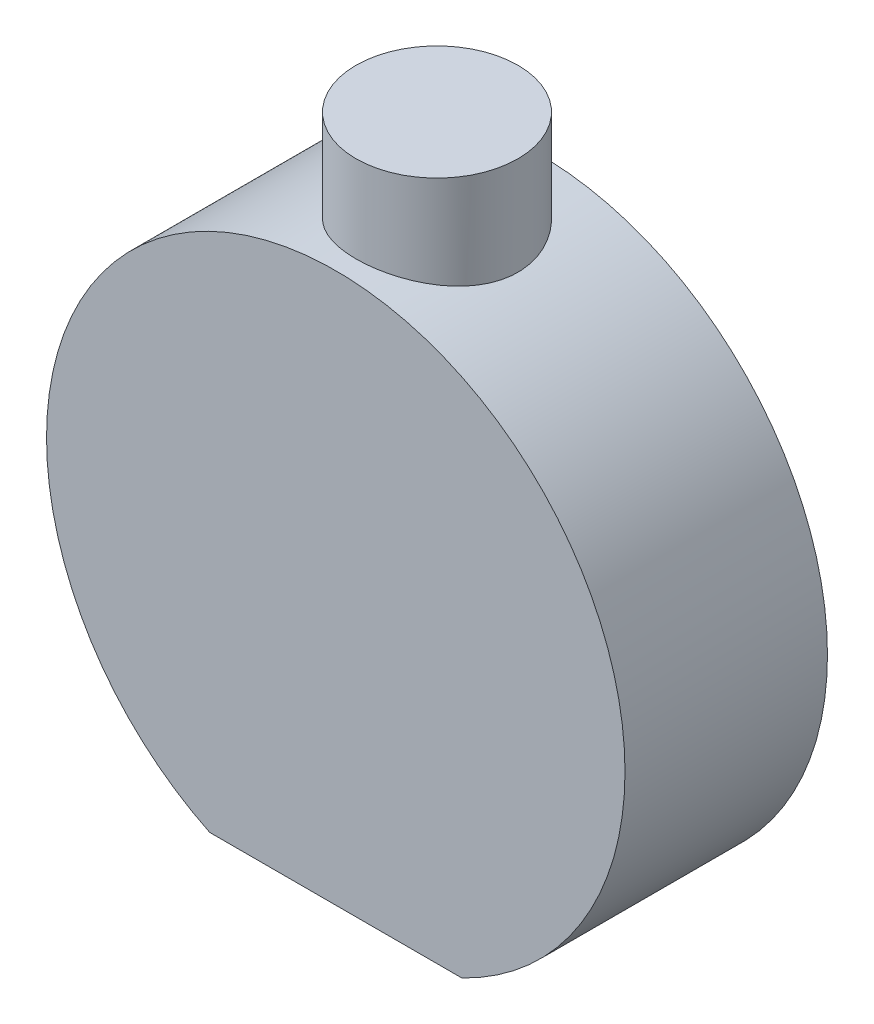
ISO-10303-21;
HEADER;
FILE_DESCRIPTION(('STEP AP214'),'2;1');
FILE_NAME('part.step','',(''),(''),'','','');
FILE_SCHEMA(('AUTOMOTIVE_DESIGN { 1 0 10303 214 1 1 1 1 }'));
ENDSEC;
DATA;
#1=APPLICATION_CONTEXT('core data for automotive mechanical design processes');
#2=APPLICATION_PROTOCOL_DEFINITION('international standard','automotive_design',2000,#1);
#3=PRODUCT_CONTEXT('',#1,'mechanical');
#4=PRODUCT('Part','Part','',(#3));
#5=PRODUCT_RELATED_PRODUCT_CATEGORY('part','',(#4));
#6=PRODUCT_DEFINITION_FORMATION('','',#4);
#7=PRODUCT_DEFINITION_CONTEXT('part definition',#1,'design');
#8=PRODUCT_DEFINITION('design','',#6,#7);
#9=PRODUCT_DEFINITION_SHAPE('','',#8);
#10=(LENGTH_UNIT() NAMED_UNIT(*) SI_UNIT(.MILLI.,.METRE.));
#11=(NAMED_UNIT(*) PLANE_ANGLE_UNIT() SI_UNIT($,.RADIAN.));
#12=(NAMED_UNIT(*) SI_UNIT($,.STERADIAN.) SOLID_ANGLE_UNIT());
#13=UNCERTAINTY_MEASURE_WITH_UNIT(LENGTH_MEASURE(1.E-05),#10,'distance_accuracy_value','');
#14=(GEOMETRIC_REPRESENTATION_CONTEXT(3) GLOBAL_UNCERTAINTY_ASSIGNED_CONTEXT((#13)) GLOBAL_UNIT_ASSIGNED_CONTEXT((#10,
#11,#12)) REPRESENTATION_CONTEXT('',''));
#15=CARTESIAN_POINT('',(0.,0.,0.));
#16=DIRECTION('',(0.,0.,1.));
#17=DIRECTION('',(1.,0.,0.));
#18=AXIS2_PLACEMENT_3D('',#15,#16,#17);
#19=CARTESIAN_POINT('',(0.,0.,35.));
#20=DIRECTION('',(0.,0.,-1.));
#21=DIRECTION('',(-1.,0.,0.));
#22=AXIS2_PLACEMENT_3D('',#19,#20,#21);
#23=CYLINDRICAL_SURFACE('',#22,50.);
#24=CARTESIAN_POINT('',(0.,0.,35.));
#25=DIRECTION('',(0.,0.,1.));
#26=DIRECTION('',(1.,0.,0.));
#27=AXIS2_PLACEMENT_3D('',#24,#25,#26);
#28=CIRCLE('',#27,50.);
#29=CARTESIAN_POINT('',(21.7944947177034,-45.,35.));
#30=VERTEX_POINT('',#29);
#31=CARTESIAN_POINT('',(-21.7944947177034,-45.,35.));
#32=VERTEX_POINT('',#31);
#33=EDGE_CURVE('E70',#30,#32,#28,.T.);
#34=ORIENTED_EDGE('',*,*,#33,.F.);
#35=DIRECTION('',(0.,0.,-1.));
#36=VECTOR('',#35,1.);
#37=CARTESIAN_POINT('',(21.7944947177034,-45.,35.));
#38=LINE('',#37,#36);
#39=CARTESIAN_POINT('',(21.7944947177034,-45.,0.));
#40=VERTEX_POINT('',#39);
#41=EDGE_CURVE('E56',#30,#40,#38,.T.);
#42=ORIENTED_EDGE('',*,*,#41,.T.);
#43=CARTESIAN_POINT('',(0.,0.,0.));
#44=DIRECTION('',(0.,0.,1.));
#45=DIRECTION('',(1.,0.,0.));
#46=AXIS2_PLACEMENT_3D('',#43,#44,#45);
#47=CIRCLE('',#46,50.);
#48=CARTESIAN_POINT('',(-21.7944947177034,-45.,0.));
#49=VERTEX_POINT('',#48);
#50=EDGE_CURVE('E68',#40,#49,#47,.T.);
#51=ORIENTED_EDGE('',*,*,#50,.T.);
#52=DIRECTION('',(0.,0.,-1.));
#53=VECTOR('',#52,1.);
#54=CARTESIAN_POINT('',(-21.7944947177034,-45.,35.));
#55=LINE('',#54,#53);
#56=EDGE_CURVE('E52',#49,#32,#55,.F.);
#57=ORIENTED_EDGE('',*,*,#56,.T.);
#58=EDGE_LOOP('',(#34,#42,#51,#57));
#59=FACE_BOUND('',#58,.T.);
#60=CARTESIAN_POINT('',(0.,50.,3.5));
#61=CARTESIAN_POINT('',(-0.385185676190636,49.9999992924288,3.50000115913061));
#62=CARTESIAN_POINT('',(-0.770392873456236,49.995538151386,3.51590982095993));
#63=CARTESIAN_POINT('',(-1.53799806270993,49.9778149547865,3.5794072156135));
#64=CARTESIAN_POINT('',(-1.92039584261679,49.9645522415681,3.62699831577969));
#65=CARTESIAN_POINT('',(-2.67973137171239,49.9295858733921,3.75346458395935));
#66=CARTESIAN_POINT('',(-3.05666709980976,49.9078791727098,3.83235104033149));
#67=CARTESIAN_POINT('',(-3.80225225446727,49.8566196497233,4.02072969999231));
#68=CARTESIAN_POINT('',(-4.17090180542134,49.8270669452904,4.13022144349563));
#69=CARTESIAN_POINT('',(-4.89687883532849,49.7609612230821,4.37873564530969));
#70=CARTESIAN_POINT('',(-5.25422130259421,49.7244179673274,4.51771695185482));
#71=CARTESIAN_POINT('',(-5.95574909823586,49.6452784376284,4.82421290223281));
#72=CARTESIAN_POINT('',(-6.2999343921284,49.6026821478211,4.99172762084207));
#73=CARTESIAN_POINT('',(-6.97295609397865,49.5125557229435,5.35405614447942));
#74=CARTESIAN_POINT('',(-7.30179191649692,49.4650253999083,5.5488709896209));
#75=CARTESIAN_POINT('',(-7.94207139841887,49.3662683852325,5.9644384977247));
#76=CARTESIAN_POINT('',(-8.25351419598592,49.3150415107128,6.18519244430841));
#77=CARTESIAN_POINT('',(-8.8639806219942,49.2090236733273,6.65648075679547));
#78=CARTESIAN_POINT('',(-9.16255940447186,49.1541780887881,6.90757920286164));
#79=CARTESIAN_POINT('',(-9.73763648602793,49.0434929391039,7.43370362251921));
#80=CARTESIAN_POINT('',(-10.01413447089,48.987653359828,7.70872993649501));
#81=CARTESIAN_POINT('',(-10.5433230575032,48.876491964402,8.28098495329776));
#82=CARTESIAN_POINT('',(-10.7960100044054,48.8211702289078,8.57821705206485));
#83=CARTESIAN_POINT('',(-11.2758613167469,48.7125803213354,9.19295546657271));
#84=CARTESIAN_POINT('',(-11.5030263496602,48.6593120955757,9.51046125175549));
#85=CARTESIAN_POINT('',(-11.9344021936297,48.5553316675749,10.1700413869155));
#86=CARTESIAN_POINT('',(-12.1380868228791,48.5046884274957,10.5124710782777));
#87=CARTESIAN_POINT('',(-12.5157995476699,48.4086021307725,11.2140257357504));
#88=CARTESIAN_POINT('',(-12.689827162623,48.3631591584023,11.5731509722902));
#89=CARTESIAN_POINT('',(-13.0068026052022,48.2788773400552,12.3055533036846));
#90=CARTESIAN_POINT('',(-13.1497554107591,48.2400374365382,12.6788281206243));
#91=CARTESIAN_POINT('',(-13.4033923144148,48.1701816581751,13.4368966761902));
#92=CARTESIAN_POINT('',(-13.5140774005763,48.1391655437623,13.8216900617109));
#93=CARTESIAN_POINT('',(-13.6998584149625,48.0866194774585,14.5903060644356));
#94=CARTESIAN_POINT('',(-13.7757659955007,48.0648741061804,14.973917824374));
#95=CARTESIAN_POINT('',(-13.8952583355435,48.0304661163162,15.7465480337994));
#96=CARTESIAN_POINT('',(-13.9388435808716,48.0178033612131,16.1355664019324));
#97=CARTESIAN_POINT('',(-13.9932820503952,48.0019672994056,16.9160091772971));
#98=CARTESIAN_POINT('',(-14.004141190918,47.9987922774801,17.3074331368157));
#99=CARTESIAN_POINT('',(-13.9930413158092,48.0020294465959,18.0897717036128));
#100=CARTESIAN_POINT('',(-13.9710828976314,48.0084414631023,18.4806863200344));
#101=CARTESIAN_POINT('',(-13.8957469319711,48.0302996684524,19.2469393630625));
#102=CARTESIAN_POINT('',(-13.843366262525,48.0454591229989,19.622384510408));
#103=CARTESIAN_POINT('',(-13.7084463020106,48.0841285408106,20.3673674282012));
#104=CARTESIAN_POINT('',(-13.6259077279711,48.1076383055401,20.7369053388802));
#105=CARTESIAN_POINT('',(-13.431355104176,48.1623182127337,21.4675743809415));
#106=CARTESIAN_POINT('',(-13.3193392940463,48.1934888126941,21.8287050088402));
#107=CARTESIAN_POINT('',(-13.0667251863583,48.2625923913377,22.5401583820001));
#108=CARTESIAN_POINT('',(-12.9261263342178,48.3005255012287,22.8904809174054));
#109=CARTESIAN_POINT('',(-12.6155178325369,48.3825878986531,23.5822883429485));
#110=CARTESIAN_POINT('',(-12.4451698151603,48.4267872315406,23.923612948545));
#111=CARTESIAN_POINT('',(-12.0775115710957,48.5197861871727,24.590753393546));
#112=CARTESIAN_POINT('',(-11.8802012302404,48.5685858293963,24.9165691672731));
#113=CARTESIAN_POINT('',(-11.4599308221783,48.6694634924242,25.5507588431263));
#114=CARTESIAN_POINT('',(-11.236966180374,48.7215420971711,25.8591296198443));
#115=CARTESIAN_POINT('',(-10.7668615024147,48.8275817703434,26.4565155401421));
#116=CARTESIAN_POINT('',(-10.519720873352,48.8815428849159,26.7455302087272));
#117=CARTESIAN_POINT('',(-9.99345181190114,48.9918949618667,27.3125372296406));
#118=CARTESIAN_POINT('',(-9.71348990141815,49.0483032364765,27.5897532355393));
#119=CARTESIAN_POINT('',(-9.13108373961511,49.1600571219356,28.1197142681883));
#120=CARTESIAN_POINT('',(-8.82863893841288,49.2154027067522,28.3724586960691));
#121=CARTESIAN_POINT('',(-8.20320348608553,49.3235050591341,28.8517700560876));
#122=CARTESIAN_POINT('',(-7.88021165650391,49.3762616779036,29.0783354846493));
#123=CARTESIAN_POINT('',(-7.21580242954661,49.4777233642508,29.5036567703283));
#124=CARTESIAN_POINT('',(-6.87438515782741,49.5264284594529,29.7024128170646));
#125=CARTESIAN_POINT('',(-6.17356183626064,49.6186726923628,30.0715873331403));
#126=CARTESIAN_POINT('',(-5.81407098352147,49.6621834561336,30.2418520330924));
#127=CARTESIAN_POINT('',(-5.08125452017009,49.7425039694038,30.5514006150044));
#128=CARTESIAN_POINT('',(-4.70792880308571,49.7793136673194,30.6906842584783));
#129=CARTESIAN_POINT('',(-3.95020852560302,49.8451645404351,30.9370580042868));
#130=CARTESIAN_POINT('',(-3.56581615598257,49.8742072416517,31.0441544311));
#131=CARTESIAN_POINT('',(-2.78876679727363,49.9236848978733,31.2252290509487));
#132=CARTESIAN_POINT('',(-2.39611006843306,49.9441201235065,31.2992082852287));
#133=CARTESIAN_POINT('',(-1.61805717297311,49.9752804795063,31.4115589420196));
#134=CARTESIAN_POINT('',(-1.2328241314592,49.9862922671569,31.4509825219863));
#135=CARTESIAN_POINT('',(-0.460267694712298,49.9993739058941,31.4977820315413));
#136=CARTESIAN_POINT('',(-0.072944343738184,50.0014439455695,31.5051586370269));
#137=CARTESIAN_POINT('',(0.700882669635061,49.9965845022968,31.4877992892049));
#138=CARTESIAN_POINT('',(1.08738641355671,49.9896559609302,31.4630666956971));
#139=CARTESIAN_POINT('',(1.85675985355689,49.9669946570147,31.3817174255323));
#140=CARTESIAN_POINT('',(2.23962957009054,49.9512619440525,31.3251009284509));
#141=CARTESIAN_POINT('',(2.99162299584796,49.9118145624355,31.1818809431436));
#142=CARTESIAN_POINT('',(3.36086941664314,49.8882595640112,31.09587638725));
#143=CARTESIAN_POINT('',(4.09065887693811,49.8337276107836,30.8943945652612));
#144=CARTESIAN_POINT('',(4.45120206082008,49.8027507791978,30.7789177884631));
#145=CARTESIAN_POINT('',(5.16123089535725,49.7341827316628,30.5193926642701));
#146=CARTESIAN_POINT('',(5.51071564740978,49.6965909798085,30.3753420018536));
#147=CARTESIAN_POINT('',(6.1963680372563,49.6157657115993,30.0597556311535));
#148=CARTESIAN_POINT('',(6.53253538131529,49.5725320708946,29.8882193170541));
#149=CARTESIAN_POINT('',(7.19638095019382,49.4805693713509,29.5149960263256));
#150=CARTESIAN_POINT('',(7.5237320186163,49.4317438714788,29.3127508891134));
#151=CARTESIAN_POINT('',(8.16032692548428,49.330649249785,28.8822980446173));
#152=CARTESIAN_POINT('',(8.46957056105044,49.2783800893938,28.6540900465245));
#153=CARTESIAN_POINT('',(9.06810402228125,49.171759424333,28.1731857847756));
#154=CARTESIAN_POINT('',(9.35739002575147,49.1174075238696,27.9204848525079));
#155=CARTESIAN_POINT('',(9.91416979539465,49.0080579887662,27.3922447045998));
#156=CARTESIAN_POINT('',(10.1816632183715,48.9530603439722,27.1167051294274));
#157=CARTESIAN_POINT('',(10.7012193187079,48.8421608333671,26.5355162195694));
#158=CARTESIAN_POINT('',(10.9525349875781,48.786284701284,26.2291936085664));
#159=CARTESIAN_POINT('',(11.428499649089,48.6769867839005,25.5960638513499));
#160=CARTESIAN_POINT('',(11.6531480273001,48.6235650551683,25.269256233415));
#161=CARTESIAN_POINT('',(12.0741648625375,48.5207328899953,24.5973043314516));
#162=CARTESIAN_POINT('',(12.27053368724,48.471322401406,24.2521602859039));
#163=CARTESIAN_POINT('',(12.6335032003754,48.3779881108645,23.5458452892058));
#164=CARTESIAN_POINT('',(12.800104362447,48.3340642216175,23.1846745931726));
#165=CARTESIAN_POINT('',(13.1013598735715,48.2532752746164,22.450839279455));
#166=CARTESIAN_POINT('',(13.2361861192523,48.2163724536723,22.0782494356364));
#167=CARTESIAN_POINT('',(13.4739284481009,48.1504775509016,21.3223326750805));
#168=CARTESIAN_POINT('',(13.5768445447514,48.1214854657325,20.93900576288));
#169=CARTESIAN_POINT('',(13.7498216041004,48.0723465464219,20.1645437945079));
#170=CARTESIAN_POINT('',(13.819890502758,48.0521975758386,19.7734106481742));
#171=CARTESIAN_POINT('',(13.9265513022617,48.0213938381014,18.9862392240218));
#172=CARTESIAN_POINT('',(13.9631442713294,48.0107387679962,18.5902011031304));
#173=CARTESIAN_POINT('',(14.0017917074529,47.9994812990816,17.8107137652908));
#174=CARTESIAN_POINT('',(14.0050504988857,47.9985283791115,17.4273288162536));
#175=CARTESIAN_POINT('',(13.980125732103,48.0057939784109,16.6616764961182));
#176=CARTESIAN_POINT('',(13.9519429741595,48.0140122642486,16.2794090968236));
#177=CARTESIAN_POINT('',(13.8643906338506,48.0393665654864,15.5187813198822));
#178=CARTESIAN_POINT('',(13.8050222078037,48.0565022502422,15.1404207979044));
#179=CARTESIAN_POINT('',(13.6556198227281,48.0991691336046,14.3902886383175));
#180=CARTESIAN_POINT('',(13.5655857103544,48.1247003741934,14.0185170336664));
#181=CARTESIAN_POINT('',(13.3566059286697,48.1831165399189,13.2876146143811));
#182=CARTESIAN_POINT('',(13.2379413887323,48.2159297247583,12.9283975673661));
#183=CARTESIAN_POINT('',(12.9722078047867,48.2881016897728,12.2213192258716));
#184=CARTESIAN_POINT('',(12.8251390543222,48.3274604023025,11.8734578140806));
#185=CARTESIAN_POINT('',(12.5036714607972,48.4116286872963,11.1912433672003));
#186=CARTESIAN_POINT('',(12.3292693185001,48.4564389176315,10.856891968953));
#187=CARTESIAN_POINT('',(11.9543640465346,48.5502884295478,10.2037697901668));
#188=CARTESIAN_POINT('',(11.7538596644656,48.5993279140129,9.88499975824102));
#189=CARTESIAN_POINT('',(11.3212231147218,48.7019598638527,9.25496553457744));
#190=CARTESIAN_POINT('',(11.0882807586624,48.7556480641094,8.94427304227665));
#191=CARTESIAN_POINT('',(10.5975625687523,48.8646582209007,8.34346569104289));
#192=CARTESIAN_POINT('',(10.3397862234098,48.9199802110692,8.05335125615853));
#193=CARTESIAN_POINT('',(9.80105652539701,49.0307546170535,7.49551887003106));
#194=CARTESIAN_POINT('',(9.52010270870159,49.0862070354589,7.22780136740253));
#195=CARTESIAN_POINT('',(8.93666734816263,49.1957732003552,6.71637665627799));
#196=CARTESIAN_POINT('',(8.63417647028583,49.2498863525558,6.47267996870283));
#197=CARTESIAN_POINT('',(8.00204714015333,49.3565846436671,6.00541617728506));
#198=CARTESIAN_POINT('',(7.67192656733382,49.4091003459171,5.78248483342788));
#199=CARTESIAN_POINT('',(6.99354244661019,49.5096745082352,5.36538698822154));
#200=CARTESIAN_POINT('',(6.64528703436728,49.5577349405789,5.17120773583054));
#201=CARTESIAN_POINT('',(5.93296797796052,49.6480486653116,4.81304720521837));
#202=CARTESIAN_POINT('',(5.56890849340582,49.6903034736836,4.64905803985019));
#203=CARTESIAN_POINT('',(4.82748498182321,49.767803298589,4.35257657465661));
#204=CARTESIAN_POINT('',(4.45012255649664,49.8030491556438,4.22008049777127));
#205=CARTESIAN_POINT('',(3.73909217438964,49.8610853081247,4.00418497186338));
#206=CARTESIAN_POINT('',(3.40680742833345,49.8849327691089,3.91648932530441));
#207=CARTESIAN_POINT('',(2.73619606812886,49.9262064290499,3.76568667566466));
#208=CARTESIAN_POINT('',(2.39786775163967,49.943630787875,3.70258671861892));
#209=CARTESIAN_POINT('',(1.71723532853191,49.9716629695942,3.60145822218926));
#210=CARTESIAN_POINT('',(1.37493159384129,49.9822714250157,3.56342735634263));
#211=CARTESIAN_POINT('',(0.688423873303446,49.9964391298677,3.51270177621407));
#212=CARTESIAN_POINT('',(0.344220530095606,50.0000006323199,3.49999896414489));
#213=CARTESIAN_POINT('',(0.,50.,3.5));
#214=B_SPLINE_CURVE_WITH_KNOTS('',3,(#60,#61,#62,#63,#64,#65,#66,#67,#68,#69,#70,#71,#72,#73,
#74,#75,#76,#77,#78,#79,#80,#81,#82,#83,#84,#85,#86,#87,#88,#89,#90,#91,#92,#93,#94,#95,#96,#97,
#98,#99,#100,#101,#102,#103,#104,#105,#106,#107,#108,#109,#110,#111,#112,#113,#114,#115,#116,
#117,#118,#119,#120,#121,#122,#123,#124,#125,#126,#127,#128,#129,#130,#131,#132,#133,#134,#135,
#136,#137,#138,#139,#140,#141,#142,#143,#144,#145,#146,#147,#148,#149,#150,#151,#152,#153,#154,
#155,#156,#157,#158,#159,#160,#161,#162,#163,#164,#165,#166,#167,#168,#169,#170,#171,#172,#173,
#174,#175,#176,#177,#178,#179,#180,#181,#182,#183,#184,#185,#186,#187,#188,#189,#190,#191,#192,
#193,#194,#195,#196,#197,#198,#199,#200,#201,#202,#203,#204,#205,#206,#207,#208,#209,#210,#211,
#212,#213),.UNSPECIFIED.,.T.,.F.,(4,2,2,2,2,2,2,2,2,2,2,2,2,2,2,2,2,2,2,2,2,2,2,2,2,2,2,2,2,2,2,
2,2,2,2,2,2,2,2,2,2,2,2,2,2,2,2,2,2,2,2,2,2,2,2,2,2,2,2,2,2,2,2,2,2,2,2,2,2,2,2,2,2,2,2,2,4),
(0.,1.15524144786114,2.31056922615247,3.46631411519789,4.62204164234098,5.77616687163025,
6.93029512553663,8.08446736278398,9.23869673942786,10.4192333740964,11.5997868051619,
12.7805211498059,13.961224607542,15.1646616048678,16.3681181018914,17.5713816727097,
18.7746083947931,19.9481103046032,21.1215945756426,22.2948666878101,23.4681174404613,
24.6049336070702,25.7417227467057,26.8785797905528,28.0154588943618,29.1662290542349,
30.3170040869981,31.4679846414408,32.6189934303619,33.8116183565011,35.004272461233,
36.1969950313586,37.3897094684705,38.5886667938458,39.787633348231,40.9863641629532,
42.1850572854832,43.3458397983783,44.5065978292854,45.6672344121246,46.8278644581254,
47.9661270184206,49.104370682535,50.2427066034639,51.3810676181013,52.5433661788434,
53.7056777597233,54.8682113267824,56.0307631982293,57.2297739238435,58.4288122699938,
59.627835025457,60.8268387013544,62.0191989193801,63.2115586336017,64.403630122296,
65.5956635704975,66.7444712585451,67.8932497070157,69.0419855634869,70.1907271643465,
71.3286178518456,72.4664967804339,73.6045131609375,74.7425841642674,75.9172806654108,
77.0920013663018,78.2667455914293,79.4420020796886,80.6459168727996,81.8492961415914,
83.0523605805548,84.2552806595291,85.2877907478812,86.3205964069193,87.3533062059896,
88.3856857781063),.UNSPECIFIED.);
#215=CARTESIAN_POINT('',(0.,50.,3.5));
#216=VERTEX_POINT('',#215);
#217=EDGE_CURVE('E45',#216,#216,#214,.T.);
#218=ORIENTED_EDGE('',*,*,#217,.F.);
#219=EDGE_LOOP('',(#218));
#220=FACE_BOUND('',#219,.T.);
#221=ADVANCED_FACE('F37',(#59,#220),#23,.T.);
#222=CARTESIAN_POINT('',(0.,0.,35.));
#223=DIRECTION('',(0.,0.,1.));
#224=DIRECTION('',(1.,0.,0.));
#225=AXIS2_PLACEMENT_3D('',#222,#223,#224);
#226=PLANE('',#225);
#227=DIRECTION('',(-1.,0.,0.));
#228=VECTOR('',#227,1.);
#229=CARTESIAN_POINT('',(0.,-45.,35.));
#230=LINE('',#229,#228);
#231=EDGE_CURVE('E71',#30,#32,#230,.T.);
#232=ORIENTED_EDGE('',*,*,#231,.F.);
#233=ORIENTED_EDGE('',*,*,#33,.T.);
#234=EDGE_LOOP('',(#232,#233));
#235=FACE_BOUND('',#234,.T.);
#236=ADVANCED_FACE('F92',(#235),#226,.T.);
#237=CARTESIAN_POINT('',(0.,0.,0.));
#238=DIRECTION('',(0.,0.,1.));
#239=DIRECTION('',(1.,0.,0.));
#240=AXIS2_PLACEMENT_3D('',#237,#238,#239);
#241=PLANE('',#240);
#242=ORIENTED_EDGE('',*,*,#50,.F.);
#243=DIRECTION('',(-1.,0.,0.));
#244=VECTOR('',#243,1.);
#245=CARTESIAN_POINT('',(0.,-45.,0.));
#246=LINE('',#245,#244);
#247=EDGE_CURVE('E11',#40,#49,#246,.T.);
#248=ORIENTED_EDGE('',*,*,#247,.T.);
#249=EDGE_LOOP('',(#242,#248));
#250=FACE_BOUND('',#249,.T.);
#251=ADVANCED_FACE('F73',(#250),#241,.F.);
#252=CARTESIAN_POINT('',(0.,65.,17.5));
#253=DIRECTION('',(0.,-1.,0.));
#254=DIRECTION('',(0.,0.,-1.));
#255=AXIS2_PLACEMENT_3D('',#252,#253,#254);
#256=CYLINDRICAL_SURFACE('',#255,14.);
#257=CARTESIAN_POINT('',(0.,65.,17.5));
#258=DIRECTION('',(0.,1.,0.));
#259=DIRECTION('',(0.,0.,1.));
#260=AXIS2_PLACEMENT_3D('',#257,#258,#259);
#261=CIRCLE('',#260,14.);
#262=CARTESIAN_POINT('',(0.,65.,31.5));
#263=VERTEX_POINT('',#262);
#264=EDGE_CURVE('E74',#263,#263,#261,.T.);
#265=ORIENTED_EDGE('',*,*,#264,.F.);
#266=EDGE_LOOP('',(#265));
#267=FACE_BOUND('',#266,.T.);
#268=ORIENTED_EDGE('',*,*,#217,.T.);
#269=EDGE_LOOP('',(#268));
#270=FACE_BOUND('',#269,.T.);
#271=ADVANCED_FACE('F84',(#267,#270),#256,.T.);
#272=CARTESIAN_POINT('',(0.,65.,17.5));
#273=DIRECTION('',(0.,1.,0.));
#274=DIRECTION('',(0.,0.,1.));
#275=AXIS2_PLACEMENT_3D('',#272,#273,#274);
#276=PLANE('',#275);
#277=ORIENTED_EDGE('',*,*,#264,.T.);
#278=EDGE_LOOP('',(#277));
#279=FACE_BOUND('',#278,.T.);
#280=ADVANCED_FACE('F89',(#279),#276,.T.);
#281=CARTESIAN_POINT('',(0.,-45.,0.));
#282=DIRECTION('',(0.,1.,0.));
#283=DIRECTION('',(0.,0.,1.));
#284=AXIS2_PLACEMENT_3D('',#281,#282,#283);
#285=PLANE('',#284);
#286=ORIENTED_EDGE('',*,*,#231,.T.);
#287=ORIENTED_EDGE('',*,*,#56,.F.);
#288=ORIENTED_EDGE('',*,*,#247,.F.);
#289=ORIENTED_EDGE('',*,*,#41,.F.);
#290=EDGE_LOOP('',(#286,#287,#288,#289));
#291=FACE_BOUND('',#290,.T.);
#292=ADVANCED_FACE('F61',(#291),#285,.F.);
#293=CLOSED_SHELL('',(#221,#236,#251,#271,#280,#292));
#294=MANIFOLD_SOLID_BREP('B2',#293);
#295=ADVANCED_BREP_SHAPE_REPRESENTATION('',(#18,#294),#14);
#296=SHAPE_DEFINITION_REPRESENTATION(#9,#295);
ENDSEC;
END-ISO-10303-21;
